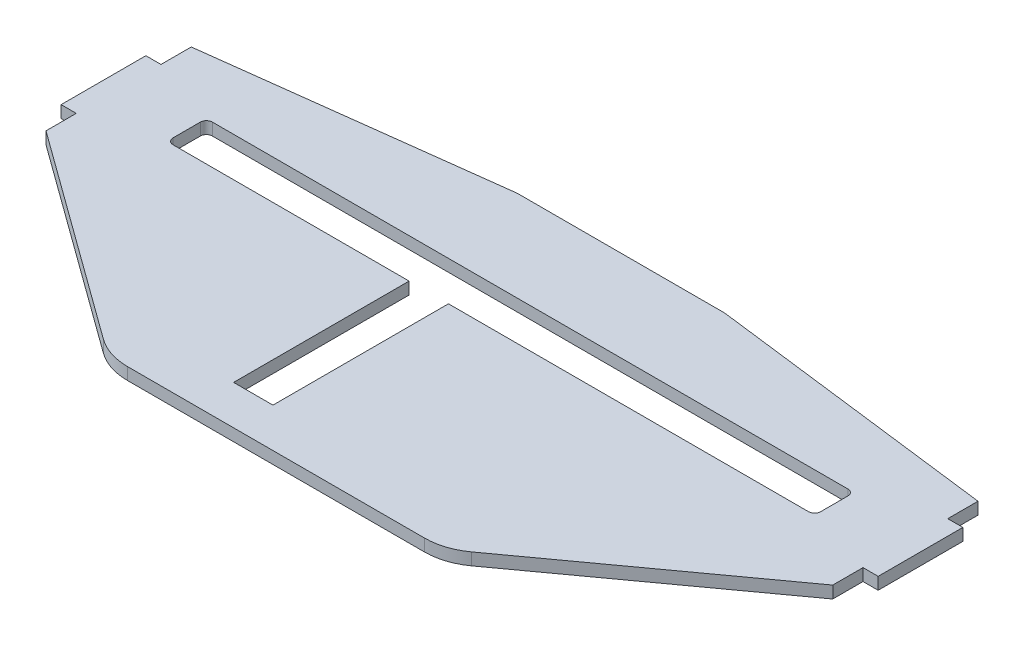
ISO-10303-21;
HEADER;
FILE_DESCRIPTION(('STEP AP214'),'2;1');
FILE_NAME('part.step','',(''),(''),'','','');
FILE_SCHEMA(('AUTOMOTIVE_DESIGN { 1 0 10303 214 1 1 1 1 }'));
ENDSEC;
DATA;
#1=APPLICATION_CONTEXT('core data for automotive mechanical design processes');
#2=APPLICATION_PROTOCOL_DEFINITION('international standard','automotive_design',2000,#1);
#3=PRODUCT_CONTEXT('',#1,'mechanical');
#4=PRODUCT('Part','Part','',(#3));
#5=PRODUCT_RELATED_PRODUCT_CATEGORY('part','',(#4));
#6=PRODUCT_DEFINITION_FORMATION('','',#4);
#7=PRODUCT_DEFINITION_CONTEXT('part definition',#1,'design');
#8=PRODUCT_DEFINITION('design','',#6,#7);
#9=PRODUCT_DEFINITION_SHAPE('','',#8);
#10=(LENGTH_UNIT() NAMED_UNIT(*) SI_UNIT(.MILLI.,.METRE.));
#11=(NAMED_UNIT(*) PLANE_ANGLE_UNIT() SI_UNIT($,.RADIAN.));
#12=(NAMED_UNIT(*) SI_UNIT($,.STERADIAN.) SOLID_ANGLE_UNIT());
#13=UNCERTAINTY_MEASURE_WITH_UNIT(LENGTH_MEASURE(1.E-05),#10,'distance_accuracy_value','');
#14=(GEOMETRIC_REPRESENTATION_CONTEXT(3) GLOBAL_UNCERTAINTY_ASSIGNED_CONTEXT((#13)) GLOBAL_UNIT_ASSIGNED_CONTEXT((#10,
#11,#12)) REPRESENTATION_CONTEXT('',''));
#15=CARTESIAN_POINT('',(0.,0.,0.));
#16=DIRECTION('',(0.,0.,1.));
#17=DIRECTION('',(1.,0.,0.));
#18=AXIS2_PLACEMENT_3D('',#15,#16,#17);
#19=CARTESIAN_POINT('',(-65.,2.,-22.690493718196));
#20=DIRECTION('',(1.,0.,0.));
#21=DIRECTION('',(0.,0.,-1.));
#22=AXIS2_PLACEMENT_3D('',#19,#20,#21);
#23=PLANE('',#22);
#24=DIRECTION('',(0.,0.,1.));
#25=VECTOR('',#24,1.);
#26=CARTESIAN_POINT('',(-65.,0.,-22.690493718196));
#27=LINE('',#26,#25);
#28=CARTESIAN_POINT('',(-65.,0.,-27.690493718196));
#29=VERTEX_POINT('',#28);
#30=CARTESIAN_POINT('',(-65.,0.,-22.690493718196));
#31=VERTEX_POINT('',#30);
#32=EDGE_CURVE('E420',#29,#31,#27,.T.);
#33=ORIENTED_EDGE('',*,*,#32,.T.);
#34=DIRECTION('',(0.,-1.,0.));
#35=VECTOR('',#34,1.);
#36=CARTESIAN_POINT('',(-65.,2.,-22.690493718196));
#37=LINE('',#36,#35);
#38=CARTESIAN_POINT('',(-65.,2.,-22.690493718196));
#39=VERTEX_POINT('',#38);
#40=EDGE_CURVE('E11',#39,#31,#37,.T.);
#41=ORIENTED_EDGE('',*,*,#40,.F.);
#42=DIRECTION('',(0.,0.,1.));
#43=VECTOR('',#42,1.);
#44=CARTESIAN_POINT('',(-65.,2.,-22.690493718196));
#45=LINE('',#44,#43);
#46=CARTESIAN_POINT('',(-65.,2.,-27.690493718196));
#47=VERTEX_POINT('',#46);
#48=EDGE_CURVE('E421',#47,#39,#45,.T.);
#49=ORIENTED_EDGE('',*,*,#48,.F.);
#50=DIRECTION('',(0.,-1.,0.));
#51=VECTOR('',#50,1.);
#52=CARTESIAN_POINT('',(-65.,2.,-27.690493718196));
#53=LINE('',#52,#51);
#54=EDGE_CURVE('E445',#47,#29,#53,.T.);
#55=ORIENTED_EDGE('',*,*,#54,.T.);
#56=EDGE_LOOP('',(#33,#41,#49,#55));
#57=FACE_BOUND('',#56,.T.);
#58=ADVANCED_FACE('F36',(#57),#23,.F.);
#59=CARTESIAN_POINT('',(-67.5,2.,-22.690493718196));
#60=DIRECTION('',(0.,0.,1.));
#61=DIRECTION('',(1.,0.,0.));
#62=AXIS2_PLACEMENT_3D('',#59,#60,#61);
#63=PLANE('',#62);
#64=DIRECTION('',(-1.,0.,0.));
#65=VECTOR('',#64,1.);
#66=CARTESIAN_POINT('',(-67.5,0.,-22.690493718196));
#67=LINE('',#66,#65);
#68=CARTESIAN_POINT('',(-67.5,0.,-22.690493718196));
#69=VERTEX_POINT('',#68);
#70=EDGE_CURVE('E448',#31,#69,#67,.T.);
#71=ORIENTED_EDGE('',*,*,#70,.T.);
#72=DIRECTION('',(0.,-1.,0.));
#73=VECTOR('',#72,1.);
#74=CARTESIAN_POINT('',(-67.5,2.,-22.690493718196));
#75=LINE('',#74,#73);
#76=CARTESIAN_POINT('',(-67.5,2.,-22.690493718196));
#77=VERTEX_POINT('',#76);
#78=EDGE_CURVE('E43',#77,#69,#75,.T.);
#79=ORIENTED_EDGE('',*,*,#78,.F.);
#80=DIRECTION('',(-1.,0.,0.));
#81=VECTOR('',#80,1.);
#82=CARTESIAN_POINT('',(-67.5,2.,-22.690493718196));
#83=LINE('',#82,#81);
#84=EDGE_CURVE('E424',#39,#77,#83,.T.);
#85=ORIENTED_EDGE('',*,*,#84,.F.);
#86=ORIENTED_EDGE('',*,*,#40,.T.);
#87=EDGE_LOOP('',(#71,#79,#85,#86));
#88=FACE_BOUND('',#87,.T.);
#89=ADVANCED_FACE('F515',(#88),#63,.F.);
#90=CARTESIAN_POINT('',(-67.5,2.,-8.69049371819603));
#91=DIRECTION('',(1.,0.,0.));
#92=DIRECTION('',(0.,0.,-1.));
#93=AXIS2_PLACEMENT_3D('',#90,#91,#92);
#94=PLANE('',#93);
#95=DIRECTION('',(0.,0.,1.));
#96=VECTOR('',#95,1.);
#97=CARTESIAN_POINT('',(-67.5,0.,-8.69049371819603));
#98=LINE('',#97,#96);
#99=CARTESIAN_POINT('',(-67.5,0.,-8.69049371819603));
#100=VERTEX_POINT('',#99);
#101=EDGE_CURVE('E450',#69,#100,#98,.T.);
#102=ORIENTED_EDGE('',*,*,#101,.T.);
#103=DIRECTION('',(0.,-1.,0.));
#104=VECTOR('',#103,1.);
#105=CARTESIAN_POINT('',(-67.5,2.,-8.69049371819603));
#106=LINE('',#105,#104);
#107=CARTESIAN_POINT('',(-67.5,2.,-8.69049371819603));
#108=VERTEX_POINT('',#107);
#109=EDGE_CURVE('E487',#108,#100,#106,.T.);
#110=ORIENTED_EDGE('',*,*,#109,.F.);
#111=DIRECTION('',(0.,0.,1.));
#112=VECTOR('',#111,1.);
#113=CARTESIAN_POINT('',(-67.5,2.,-8.69049371819603));
#114=LINE('',#113,#112);
#115=EDGE_CURVE('E427',#77,#108,#114,.T.);
#116=ORIENTED_EDGE('',*,*,#115,.F.);
#117=ORIENTED_EDGE('',*,*,#78,.T.);
#118=EDGE_LOOP('',(#102,#110,#116,#117));
#119=FACE_BOUND('',#118,.T.);
#120=ADVANCED_FACE('F494',(#119),#94,.F.);
#121=CARTESIAN_POINT('',(-65.,2.,-8.69049371819603));
#122=DIRECTION('',(0.,0.,-1.));
#123=DIRECTION('',(-1.,0.,0.));
#124=AXIS2_PLACEMENT_3D('',#121,#122,#123);
#125=PLANE('',#124);
#126=DIRECTION('',(1.,0.,0.));
#127=VECTOR('',#126,1.);
#128=CARTESIAN_POINT('',(-65.,0.,-8.69049371819603));
#129=LINE('',#128,#127);
#130=CARTESIAN_POINT('',(-65.,0.,-8.69049371819603));
#131=VERTEX_POINT('',#130);
#132=EDGE_CURVE('E452',#100,#131,#129,.T.);
#133=ORIENTED_EDGE('',*,*,#132,.T.);
#134=DIRECTION('',(0.,-1.,0.));
#135=VECTOR('',#134,1.);
#136=CARTESIAN_POINT('',(-65.,2.,-8.69049371819603));
#137=LINE('',#136,#135);
#138=CARTESIAN_POINT('',(-65.,2.,-8.69049371819603));
#139=VERTEX_POINT('',#138);
#140=EDGE_CURVE('E484',#139,#131,#137,.T.);
#141=ORIENTED_EDGE('',*,*,#140,.F.);
#142=DIRECTION('',(1.,0.,0.));
#143=VECTOR('',#142,1.);
#144=CARTESIAN_POINT('',(-65.,2.,-8.69049371819603));
#145=LINE('',#144,#143);
#146=EDGE_CURVE('E429',#108,#139,#145,.T.);
#147=ORIENTED_EDGE('',*,*,#146,.F.);
#148=ORIENTED_EDGE('',*,*,#109,.T.);
#149=EDGE_LOOP('',(#133,#141,#147,#148));
#150=FACE_BOUND('',#149,.T.);
#151=ADVANCED_FACE('F503',(#150),#125,.F.);
#152=CARTESIAN_POINT('',(-65.,2.,-3.69049371819603));
#153=DIRECTION('',(1.,0.,0.));
#154=DIRECTION('',(0.,0.,-1.));
#155=AXIS2_PLACEMENT_3D('',#152,#153,#154);
#156=PLANE('',#155);
#157=DIRECTION('',(0.,0.,1.));
#158=VECTOR('',#157,1.);
#159=CARTESIAN_POINT('',(-65.,0.,-3.69049371819603));
#160=LINE('',#159,#158);
#161=CARTESIAN_POINT('',(-65.,0.,-3.69049371819603));
#162=VERTEX_POINT('',#161);
#163=EDGE_CURVE('E454',#131,#162,#160,.T.);
#164=ORIENTED_EDGE('',*,*,#163,.T.);
#165=DIRECTION('',(0.,-1.,0.));
#166=VECTOR('',#165,1.);
#167=CARTESIAN_POINT('',(-65.,2.,-3.69049371819603));
#168=LINE('',#167,#166);
#169=CARTESIAN_POINT('',(-65.,2.,-3.69049371819603));
#170=VERTEX_POINT('',#169);
#171=EDGE_CURVE('E481',#170,#162,#168,.T.);
#172=ORIENTED_EDGE('',*,*,#171,.F.);
#173=DIRECTION('',(0.,0.,1.));
#174=VECTOR('',#173,1.);
#175=CARTESIAN_POINT('',(-65.,2.,-3.69049371819603));
#176=LINE('',#175,#174);
#177=EDGE_CURVE('E431',#139,#170,#176,.T.);
#178=ORIENTED_EDGE('',*,*,#177,.F.);
#179=ORIENTED_EDGE('',*,*,#140,.T.);
#180=EDGE_LOOP('',(#164,#172,#178,#179));
#181=FACE_BOUND('',#180,.T.);
#182=ADVANCED_FACE('F507',(#181),#156,.F.);
#183=CARTESIAN_POINT('',(-30.4139007462659,2.,21.4034902651962));
#184=DIRECTION('',(0.587259936285379,0.,-0.809398398339219));
#185=DIRECTION('',(-0.809398398339219,0.,-0.587259936285379));
#186=AXIS2_PLACEMENT_3D('',#183,#184,#185);
#187=PLANE('',#186);
#188=DIRECTION('',(0.809398398339219,0.,0.587259936285379));
#189=VECTOR('',#188,1.);
#190=CARTESIAN_POINT('',(-30.4139007462659,0.,21.4034902651962));
#191=LINE('',#190,#189);
#192=CARTESIAN_POINT('',(-30.4139007462659,0.,21.4034902651962));
#193=VERTEX_POINT('',#192);
#194=EDGE_CURVE('E456',#162,#193,#191,.T.);
#195=ORIENTED_EDGE('',*,*,#194,.T.);
#196=DIRECTION('',(0.,-1.,0.));
#197=VECTOR('',#196,1.);
#198=CARTESIAN_POINT('',(-30.4139007462659,2.,21.4034902651962));
#199=LINE('',#198,#197);
#200=CARTESIAN_POINT('',(-30.4139007462659,2.,21.4034902651962));
#201=VERTEX_POINT('',#200);
#202=EDGE_CURVE('E478',#201,#193,#199,.T.);
#203=ORIENTED_EDGE('',*,*,#202,.F.);
#204=DIRECTION('',(0.809398398339219,0.,0.587259936285379));
#205=VECTOR('',#204,1.);
#206=CARTESIAN_POINT('',(-30.4139007462659,2.,21.4034902651962));
#207=LINE('',#206,#205);
#208=EDGE_CURVE('E433',#170,#201,#207,.T.);
#209=ORIENTED_EDGE('',*,*,#208,.F.);
#210=ORIENTED_EDGE('',*,*,#171,.T.);
#211=EDGE_LOOP('',(#195,#203,#209,#210));
#212=FACE_BOUND('',#211,.T.);
#213=ADVANCED_FACE('F578',(#212),#187,.F.);
#214=CARTESIAN_POINT('',(-24.5413013834122,2.,13.309506281804));
#215=DIRECTION('',(0.,-1.,0.));
#216=DIRECTION('',(0.,0.,-1.));
#217=AXIS2_PLACEMENT_3D('',#214,#215,#216);
#218=CYLINDRICAL_SURFACE('',#217,10.);
#219=CARTESIAN_POINT('',(-24.5413013834122,0.,13.309506281804));
#220=DIRECTION('',(0.,1.,0.));
#221=DIRECTION('',(0.,0.,-1.));
#222=AXIS2_PLACEMENT_3D('',#219,#220,#221);
#223=CIRCLE('',#222,10.);
#224=CARTESIAN_POINT('',(-24.5413013834122,0.,23.309506281804));
#225=VERTEX_POINT('',#224);
#226=EDGE_CURVE('E458',#193,#225,#223,.T.);
#227=ORIENTED_EDGE('',*,*,#226,.T.);
#228=DIRECTION('',(0.,-1.,0.));
#229=VECTOR('',#228,1.);
#230=CARTESIAN_POINT('',(-24.5413013834122,2.,23.309506281804));
#231=LINE('',#230,#229);
#232=CARTESIAN_POINT('',(-24.5413013834122,2.,23.309506281804));
#233=VERTEX_POINT('',#232);
#234=EDGE_CURVE('E475',#233,#225,#231,.T.);
#235=ORIENTED_EDGE('',*,*,#234,.F.);
#236=CARTESIAN_POINT('',(-24.5413013834122,2.,13.309506281804));
#237=DIRECTION('',(0.,1.,0.));
#238=DIRECTION('',(0.,0.,-1.));
#239=AXIS2_PLACEMENT_3D('',#236,#237,#238);
#240=CIRCLE('',#239,10.);
#241=EDGE_CURVE('E435',#201,#233,#240,.T.);
#242=ORIENTED_EDGE('',*,*,#241,.F.);
#243=ORIENTED_EDGE('',*,*,#202,.T.);
#244=EDGE_LOOP('',(#227,#235,#242,#243));
#245=FACE_BOUND('',#244,.T.);
#246=ADVANCED_FACE('F576',(#245),#218,.T.);
#247=CARTESIAN_POINT('',(0.,2.,23.309506281804));
#248=DIRECTION('',(0.,0.,-1.));
#249=DIRECTION('',(-1.,0.,0.));
#250=AXIS2_PLACEMENT_3D('',#247,#248,#249);
#251=PLANE('',#250);
#252=DIRECTION('',(1.,0.,0.));
#253=VECTOR('',#252,1.);
#254=CARTESIAN_POINT('',(0.,0.,23.309506281804));
#255=LINE('',#254,#253);
#256=CARTESIAN_POINT('',(24.5413013834122,0.,23.309506281804));
#257=VERTEX_POINT('',#256);
#258=EDGE_CURVE('E460',#225,#257,#255,.T.);
#259=ORIENTED_EDGE('',*,*,#258,.T.);
#260=DIRECTION('',(0.,-1.,0.));
#261=VECTOR('',#260,1.);
#262=CARTESIAN_POINT('',(24.5413013834122,2.,23.309506281804));
#263=LINE('',#262,#261);
#264=CARTESIAN_POINT('',(24.5413013834122,2.,23.309506281804));
#265=VERTEX_POINT('',#264);
#266=EDGE_CURVE('E410',#265,#257,#263,.T.);
#267=ORIENTED_EDGE('',*,*,#266,.F.);
#268=DIRECTION('',(1.,0.,0.));
#269=VECTOR('',#268,1.);
#270=CARTESIAN_POINT('',(0.,2.,23.309506281804));
#271=LINE('',#270,#269);
#272=EDGE_CURVE('E437',#233,#265,#271,.T.);
#273=ORIENTED_EDGE('',*,*,#272,.F.);
#274=ORIENTED_EDGE('',*,*,#234,.T.);
#275=EDGE_LOOP('',(#259,#267,#273,#274));
#276=FACE_BOUND('',#275,.T.);
#277=ADVANCED_FACE('F572',(#276),#251,.F.);
#278=CARTESIAN_POINT('',(-16.5303257419357,2.,-33.690493718196));
#279=DIRECTION('',(0.,0.,1.));
#280=DIRECTION('',(1.,0.,0.));
#281=AXIS2_PLACEMENT_3D('',#278,#279,#280);
#282=PLANE('',#281);
#283=DIRECTION('',(-1.,0.,0.));
#284=VECTOR('',#283,1.);
#285=CARTESIAN_POINT('',(-16.5303257419357,0.,-33.690493718196));
#286=LINE('',#285,#284);
#287=CARTESIAN_POINT('',(16.5303257419357,0.,-33.690493718196));
#288=VERTEX_POINT('',#287);
#289=CARTESIAN_POINT('',(-16.5303257419357,0.,-33.690493718196));
#290=VERTEX_POINT('',#289);
#291=EDGE_CURVE('E462',#288,#290,#286,.T.);
#292=ORIENTED_EDGE('',*,*,#291,.T.);
#293=DIRECTION('',(0.,-1.,0.));
#294=VECTOR('',#293,1.);
#295=CARTESIAN_POINT('',(-16.5303257419357,2.,-33.690493718196));
#296=LINE('',#295,#294);
#297=CARTESIAN_POINT('',(-16.5303257419357,2.,-33.690493718196));
#298=VERTEX_POINT('',#297);
#299=EDGE_CURVE('E472',#298,#290,#296,.T.);
#300=ORIENTED_EDGE('',*,*,#299,.F.);
#301=DIRECTION('',(-1.,0.,0.));
#302=VECTOR('',#301,1.);
#303=CARTESIAN_POINT('',(-16.5303257419357,2.,-33.690493718196));
#304=LINE('',#303,#302);
#305=CARTESIAN_POINT('',(16.5303257419357,2.,-33.690493718196));
#306=VERTEX_POINT('',#305);
#307=EDGE_CURVE('E439',#306,#298,#304,.T.);
#308=ORIENTED_EDGE('',*,*,#307,.F.);
#309=DIRECTION('',(0.,-1.,0.));
#310=VECTOR('',#309,1.);
#311=CARTESIAN_POINT('',(16.5303257419357,2.,-33.690493718196));
#312=LINE('',#311,#310);
#313=EDGE_CURVE('E413',#306,#288,#312,.T.);
#314=ORIENTED_EDGE('',*,*,#313,.T.);
#315=EDGE_LOOP('',(#292,#300,#308,#314));
#316=FACE_BOUND('',#315,.T.);
#317=ADVANCED_FACE('F529',(#316),#282,.F.);
#318=CARTESIAN_POINT('',(-16.5303257419357,2.,-23.690493718196));
#319=DIRECTION('',(0.,-1.,0.));
#320=DIRECTION('',(0.,0.,-1.));
#321=AXIS2_PLACEMENT_3D('',#318,#319,#320);
#322=CYLINDRICAL_SURFACE('',#321,10.);
#323=CARTESIAN_POINT('',(-16.5303257419357,0.,-23.690493718196));
#324=DIRECTION('',(0.,1.,0.));
#325=DIRECTION('',(0.,0.,1.));
#326=AXIS2_PLACEMENT_3D('',#323,#324,#325);
#327=CIRCLE('',#326,10.);
#328=CARTESIAN_POINT('',(-17.7746267588119,0.,-33.6127774764546));
#329=VERTEX_POINT('',#328);
#330=EDGE_CURVE('E464',#290,#329,#327,.T.);
#331=ORIENTED_EDGE('',*,*,#330,.T.);
#332=DIRECTION('',(0.,-1.,0.));
#333=VECTOR('',#332,1.);
#334=CARTESIAN_POINT('',(-17.7746267588119,2.,-33.6127774764546));
#335=LINE('',#334,#333);
#336=CARTESIAN_POINT('',(-17.7746267588119,2.,-33.6127774764546));
#337=VERTEX_POINT('',#336);
#338=EDGE_CURVE('E469',#337,#329,#335,.T.);
#339=ORIENTED_EDGE('',*,*,#338,.F.);
#340=CARTESIAN_POINT('',(-16.5303257419357,2.,-23.690493718196));
#341=DIRECTION('',(0.,1.,0.));
#342=DIRECTION('',(0.,0.,1.));
#343=AXIS2_PLACEMENT_3D('',#340,#341,#342);
#344=CIRCLE('',#343,10.);
#345=EDGE_CURVE('E441',#298,#337,#344,.T.);
#346=ORIENTED_EDGE('',*,*,#345,.F.);
#347=ORIENTED_EDGE('',*,*,#299,.T.);
#348=EDGE_LOOP('',(#331,#339,#346,#347));
#349=FACE_BOUND('',#348,.T.);
#350=ADVANCED_FACE('F526',(#349),#322,.T.);
#351=CARTESIAN_POINT('',(-65.,2.,-27.690493718196));
#352=DIRECTION('',(0.124430101687617,0.,0.992228375825853));
#353=DIRECTION('',(0.992228375825853,0.,-0.124430101687617));
#354=AXIS2_PLACEMENT_3D('',#351,#352,#353);
#355=PLANE('',#354);
#356=DIRECTION('',(-0.992228375825853,0.,0.124430101687617));
#357=VECTOR('',#356,1.);
#358=CARTESIAN_POINT('',(-65.,0.,-27.690493718196));
#359=LINE('',#358,#357);
#360=EDGE_CURVE('E425',#329,#29,#359,.T.);
#361=ORIENTED_EDGE('',*,*,#360,.T.);
#362=ORIENTED_EDGE('',*,*,#54,.F.);
#363=DIRECTION('',(-0.992228375825853,0.,0.124430101687617));
#364=VECTOR('',#363,1.);
#365=CARTESIAN_POINT('',(-65.,2.,-27.690493718196));
#366=LINE('',#365,#364);
#367=EDGE_CURVE('E443',#337,#47,#366,.T.);
#368=ORIENTED_EDGE('',*,*,#367,.F.);
#369=ORIENTED_EDGE('',*,*,#338,.T.);
#370=EDGE_LOOP('',(#361,#362,#368,#369));
#371=FACE_BOUND('',#370,.T.);
#372=ADVANCED_FACE('F521',(#371),#355,.F.);
#373=CARTESIAN_POINT('',(-16.5303257419357,2.,-23.690493718196));
#374=DIRECTION('',(0.,1.,0.));
#375=DIRECTION('',(0.,0.,1.));
#376=AXIS2_PLACEMENT_3D('',#373,#374,#375);
#377=PLANE('',#376);
#378=CARTESIAN_POINT('',(52.5,2.,-13.190493718196));
#379=DIRECTION('',(0.,1.,0.));
#380=DIRECTION('',(0.,0.,-1.));
#381=AXIS2_PLACEMENT_3D('',#378,#379,#380);
#382=CIRCLE('',#381,0.999999999999997);
#383=CARTESIAN_POINT('',(52.5,2.,-12.190493718196));
#384=VERTEX_POINT('',#383);
#385=CARTESIAN_POINT('',(53.5,2.,-13.190493718196));
#386=VERTEX_POINT('',#385);
#387=EDGE_CURVE('E50',#384,#386,#382,.T.);
#388=ORIENTED_EDGE('',*,*,#387,.F.);
#389=DIRECTION('',(1.,0.,0.));
#390=VECTOR('',#389,1.);
#391=CARTESIAN_POINT('',(-6.99999999999999,2.,-12.190493718196));
#392=LINE('',#391,#390);
#393=CARTESIAN_POINT('',(-6.99999999999999,2.,-12.190493718196));
#394=VERTEX_POINT('',#393);
#395=EDGE_CURVE('E263',#394,#384,#392,.T.);
#396=ORIENTED_EDGE('',*,*,#395,.F.);
#397=DIRECTION('',(0.,0.,-1.));
#398=VECTOR('',#397,1.);
#399=CARTESIAN_POINT('',(-6.99999999999999,2.,16.809506281804));
#400=LINE('',#399,#398);
#401=CARTESIAN_POINT('',(-6.99999999999999,2.,16.809506281804));
#402=VERTEX_POINT('',#401);
#403=EDGE_CURVE('E266',#402,#394,#400,.T.);
#404=ORIENTED_EDGE('',*,*,#403,.F.);
#405=DIRECTION('',(1.,0.,0.));
#406=VECTOR('',#405,1.);
#407=CARTESIAN_POINT('',(-13.5,2.,16.809506281804));
#408=LINE('',#407,#406);
#409=CARTESIAN_POINT('',(-13.5,2.,16.809506281804));
#410=VERTEX_POINT('',#409);
#411=EDGE_CURVE('E318',#410,#402,#408,.T.);
#412=ORIENTED_EDGE('',*,*,#411,.F.);
#413=DIRECTION('',(0.,0.,1.));
#414=VECTOR('',#413,1.);
#415=CARTESIAN_POINT('',(-13.5,2.,16.809506281804));
#416=LINE('',#415,#414);
#417=CARTESIAN_POINT('',(-13.5,2.,-12.190493718196));
#418=VERTEX_POINT('',#417);
#419=EDGE_CURVE('E315',#418,#410,#416,.T.);
#420=ORIENTED_EDGE('',*,*,#419,.F.);
#421=DIRECTION('',(1.,0.,0.));
#422=VECTOR('',#421,1.);
#423=CARTESIAN_POINT('',(-52.5,2.,-12.190493718196));
#424=LINE('',#423,#422);
#425=CARTESIAN_POINT('',(-52.5,2.,-12.190493718196));
#426=VERTEX_POINT('',#425);
#427=EDGE_CURVE('E312',#426,#418,#424,.T.);
#428=ORIENTED_EDGE('',*,*,#427,.F.);
#429=CARTESIAN_POINT('',(-52.5,2.,-13.190493718196));
#430=DIRECTION('',(0.,1.,0.));
#431=DIRECTION('',(0.,0.,1.));
#432=AXIS2_PLACEMENT_3D('',#429,#430,#431);
#433=CIRCLE('',#432,1.);
#434=CARTESIAN_POINT('',(-53.5,2.,-13.190493718196));
#435=VERTEX_POINT('',#434);
#436=EDGE_CURVE('E309',#435,#426,#433,.T.);
#437=ORIENTED_EDGE('',*,*,#436,.F.);
#438=DIRECTION('',(0.,0.,1.));
#439=VECTOR('',#438,1.);
#440=CARTESIAN_POINT('',(-53.5,2.,-17.690493718196));
#441=LINE('',#440,#439);
#442=CARTESIAN_POINT('',(-53.5,2.,-17.690493718196));
#443=VERTEX_POINT('',#442);
#444=EDGE_CURVE('E306',#443,#435,#441,.T.);
#445=ORIENTED_EDGE('',*,*,#444,.F.);
#446=CARTESIAN_POINT('',(-52.5,2.,-17.690493718196));
#447=DIRECTION('',(0.,1.,0.));
#448=DIRECTION('',(0.,0.,-1.));
#449=AXIS2_PLACEMENT_3D('',#446,#447,#448);
#450=CIRCLE('',#449,1.);
#451=CARTESIAN_POINT('',(-52.5,2.,-18.690493718196));
#452=VERTEX_POINT('',#451);
#453=EDGE_CURVE('E303',#452,#443,#450,.T.);
#454=ORIENTED_EDGE('',*,*,#453,.F.);
#455=DIRECTION('',(-1.,0.,0.));
#456=VECTOR('',#455,1.);
#457=CARTESIAN_POINT('',(-52.5,2.,-18.690493718196));
#458=LINE('',#457,#456);
#459=CARTESIAN_POINT('',(52.5,2.,-18.690493718196));
#460=VERTEX_POINT('',#459);
#461=EDGE_CURVE('E300',#460,#452,#458,.T.);
#462=ORIENTED_EDGE('',*,*,#461,.F.);
#463=CARTESIAN_POINT('',(52.5,2.,-17.690493718196));
#464=DIRECTION('',(0.,1.,0.));
#465=DIRECTION('',(0.,0.,1.));
#466=AXIS2_PLACEMENT_3D('',#463,#464,#465);
#467=CIRCLE('',#466,0.999999999999999);
#468=CARTESIAN_POINT('',(53.5,2.,-17.690493718196));
#469=VERTEX_POINT('',#468);
#470=EDGE_CURVE('E297',#469,#460,#467,.T.);
#471=ORIENTED_EDGE('',*,*,#470,.F.);
#472=DIRECTION('',(0.,0.,-1.));
#473=VECTOR('',#472,1.);
#474=CARTESIAN_POINT('',(53.5,2.,-17.690493718196));
#475=LINE('',#474,#473);
#476=EDGE_CURVE('E295',#386,#469,#475,.T.);
#477=ORIENTED_EDGE('',*,*,#476,.F.);
#478=EDGE_LOOP('',(#388,#396,#404,#412,#420,#428,#437,#445,#454,#462,#471,#477));
#479=FACE_BOUND('',#478,.T.);
#480=ORIENTED_EDGE('',*,*,#48,.T.);
#481=ORIENTED_EDGE('',*,*,#84,.T.);
#482=ORIENTED_EDGE('',*,*,#115,.T.);
#483=ORIENTED_EDGE('',*,*,#146,.T.);
#484=ORIENTED_EDGE('',*,*,#177,.T.);
#485=ORIENTED_EDGE('',*,*,#208,.T.);
#486=ORIENTED_EDGE('',*,*,#241,.T.);
#487=ORIENTED_EDGE('',*,*,#272,.T.);
#488=CARTESIAN_POINT('',(24.5413013834122,2.,13.309506281804));
#489=DIRECTION('',(0.,-1.,0.));
#490=DIRECTION('',(0.,0.,-1.));
#491=AXIS2_PLACEMENT_3D('',#488,#489,#490);
#492=CIRCLE('',#491,10.);
#493=CARTESIAN_POINT('',(30.4139007462659,2.,21.4034902651962));
#494=VERTEX_POINT('',#493);
#495=EDGE_CURVE('E355',#494,#265,#492,.T.);
#496=ORIENTED_EDGE('',*,*,#495,.F.);
#497=DIRECTION('',(-0.809398398339219,0.,0.587259936285379));
#498=VECTOR('',#497,1.);
#499=CARTESIAN_POINT('',(30.4139007462659,2.,21.4034902651962));
#500=LINE('',#499,#498);
#501=CARTESIAN_POINT('',(65.,2.,-3.69049371819604));
#502=VERTEX_POINT('',#501);
#503=EDGE_CURVE('E358',#502,#494,#500,.T.);
#504=ORIENTED_EDGE('',*,*,#503,.F.);
#505=DIRECTION('',(0.,0.,1.));
#506=VECTOR('',#505,1.);
#507=CARTESIAN_POINT('',(65.,2.,-3.69049371819604));
#508=LINE('',#507,#506);
#509=CARTESIAN_POINT('',(65.,2.,-8.69049371819604));
#510=VERTEX_POINT('',#509);
#511=EDGE_CURVE('E361',#510,#502,#508,.T.);
#512=ORIENTED_EDGE('',*,*,#511,.F.);
#513=DIRECTION('',(-1.,0.,0.));
#514=VECTOR('',#513,1.);
#515=CARTESIAN_POINT('',(65.,2.,-8.69049371819604));
#516=LINE('',#515,#514);
#517=CARTESIAN_POINT('',(67.5,2.,-8.69049371819604));
#518=VERTEX_POINT('',#517);
#519=EDGE_CURVE('E364',#518,#510,#516,.T.);
#520=ORIENTED_EDGE('',*,*,#519,.F.);
#521=DIRECTION('',(0.,0.,1.));
#522=VECTOR('',#521,1.);
#523=CARTESIAN_POINT('',(67.5,2.,-8.69049371819604));
#524=LINE('',#523,#522);
#525=CARTESIAN_POINT('',(67.5,2.,-22.690493718196));
#526=VERTEX_POINT('',#525);
#527=EDGE_CURVE('E367',#526,#518,#524,.T.);
#528=ORIENTED_EDGE('',*,*,#527,.F.);
#529=DIRECTION('',(1.,0.,0.));
#530=VECTOR('',#529,1.);
#531=CARTESIAN_POINT('',(67.5,2.,-22.690493718196));
#532=LINE('',#531,#530);
#533=CARTESIAN_POINT('',(65.,2.,-22.690493718196));
#534=VERTEX_POINT('',#533);
#535=EDGE_CURVE('E370',#534,#526,#532,.T.);
#536=ORIENTED_EDGE('',*,*,#535,.F.);
#537=DIRECTION('',(0.,0.,1.));
#538=VECTOR('',#537,1.);
#539=CARTESIAN_POINT('',(65.,2.,-22.690493718196));
#540=LINE('',#539,#538);
#541=CARTESIAN_POINT('',(65.,2.,-27.690493718196));
#542=VERTEX_POINT('',#541);
#543=EDGE_CURVE('E345',#542,#534,#540,.T.);
#544=ORIENTED_EDGE('',*,*,#543,.F.);
#545=DIRECTION('',(0.992228375825853,0.,0.124430101687617));
#546=VECTOR('',#545,1.);
#547=CARTESIAN_POINT('',(65.,2.,-27.690493718196));
#548=LINE('',#547,#546);
#549=CARTESIAN_POINT('',(17.7746267588119,2.,-33.6127774764546));
#550=VERTEX_POINT('',#549);
#551=EDGE_CURVE('E348',#550,#542,#548,.T.);
#552=ORIENTED_EDGE('',*,*,#551,.F.);
#553=CARTESIAN_POINT('',(16.5303257419357,2.,-23.690493718196));
#554=DIRECTION('',(0.,-1.,0.));
#555=DIRECTION('',(0.,0.,1.));
#556=AXIS2_PLACEMENT_3D('',#553,#554,#555);
#557=CIRCLE('',#556,10.);
#558=EDGE_CURVE('E352',#306,#550,#557,.T.);
#559=ORIENTED_EDGE('',*,*,#558,.F.);
#560=ORIENTED_EDGE('',*,*,#307,.T.);
#561=ORIENTED_EDGE('',*,*,#345,.T.);
#562=ORIENTED_EDGE('',*,*,#367,.T.);
#563=EDGE_LOOP('',(#480,#481,#482,#483,#484,#485,#486,#487,#496,#504,#512,#520,#528,#536,#544,
#552,#559,#560,#561,#562));
#564=FACE_BOUND('',#563,.T.);
#565=ADVANCED_FACE('F511',(#479,#564),#377,.T.);
#566=CARTESIAN_POINT('',(-16.5303257419357,0.,-23.690493718196));
#567=DIRECTION('',(0.,1.,0.));
#568=DIRECTION('',(0.,0.,1.));
#569=AXIS2_PLACEMENT_3D('',#566,#567,#568);
#570=PLANE('',#569);
#571=DIRECTION('',(1.,0.,0.));
#572=VECTOR('',#571,1.);
#573=CARTESIAN_POINT('',(-6.99999999999999,0.,-12.190493718196));
#574=LINE('',#573,#572);
#575=CARTESIAN_POINT('',(-6.99999999999999,0.,-12.190493718196));
#576=VERTEX_POINT('',#575);
#577=CARTESIAN_POINT('',(52.5,0.,-12.190493718196));
#578=VERTEX_POINT('',#577);
#579=EDGE_CURVE('E252',#576,#578,#574,.T.);
#580=ORIENTED_EDGE('',*,*,#579,.T.);
#581=CARTESIAN_POINT('',(52.5,0.,-13.190493718196));
#582=DIRECTION('',(0.,1.,0.));
#583=DIRECTION('',(0.,0.,-1.));
#584=AXIS2_PLACEMENT_3D('',#581,#582,#583);
#585=CIRCLE('',#584,0.999999999999997);
#586=CARTESIAN_POINT('',(53.5,0.,-13.190493718196));
#587=VERTEX_POINT('',#586);
#588=EDGE_CURVE('E246',#578,#587,#585,.T.);
#589=ORIENTED_EDGE('',*,*,#588,.T.);
#590=DIRECTION('',(0.,0.,-1.));
#591=VECTOR('',#590,1.);
#592=CARTESIAN_POINT('',(53.5,0.,-17.690493718196));
#593=LINE('',#592,#591);
#594=CARTESIAN_POINT('',(53.5,0.,-17.690493718196));
#595=VERTEX_POINT('',#594);
#596=EDGE_CURVE('E255',#587,#595,#593,.T.);
#597=ORIENTED_EDGE('',*,*,#596,.T.);
#598=CARTESIAN_POINT('',(52.5,0.,-17.690493718196));
#599=DIRECTION('',(0.,1.,0.));
#600=DIRECTION('',(0.,0.,1.));
#601=AXIS2_PLACEMENT_3D('',#598,#599,#600);
#602=CIRCLE('',#601,0.999999999999999);
#603=CARTESIAN_POINT('',(52.5,0.,-18.690493718196));
#604=VERTEX_POINT('',#603);
#605=EDGE_CURVE('E58',#595,#604,#602,.T.);
#606=ORIENTED_EDGE('',*,*,#605,.T.);
#607=DIRECTION('',(-1.,0.,0.));
#608=VECTOR('',#607,1.);
#609=CARTESIAN_POINT('',(-52.5,0.,-18.690493718196));
#610=LINE('',#609,#608);
#611=CARTESIAN_POINT('',(-52.5,0.,-18.690493718196));
#612=VERTEX_POINT('',#611);
#613=EDGE_CURVE('E270',#604,#612,#610,.T.);
#614=ORIENTED_EDGE('',*,*,#613,.T.);
#615=CARTESIAN_POINT('',(-52.5,0.,-17.690493718196));
#616=DIRECTION('',(0.,1.,0.));
#617=DIRECTION('',(0.,0.,-1.));
#618=AXIS2_PLACEMENT_3D('',#615,#616,#617);
#619=CIRCLE('',#618,1.);
#620=CARTESIAN_POINT('',(-53.5,0.,-17.690493718196));
#621=VERTEX_POINT('',#620);
#622=EDGE_CURVE('E273',#612,#621,#619,.T.);
#623=ORIENTED_EDGE('',*,*,#622,.T.);
#624=DIRECTION('',(0.,0.,1.));
#625=VECTOR('',#624,1.);
#626=CARTESIAN_POINT('',(-53.5,0.,-17.690493718196));
#627=LINE('',#626,#625);
#628=CARTESIAN_POINT('',(-53.5,0.,-13.190493718196));
#629=VERTEX_POINT('',#628);
#630=EDGE_CURVE('E276',#621,#629,#627,.T.);
#631=ORIENTED_EDGE('',*,*,#630,.T.);
#632=CARTESIAN_POINT('',(-52.5,0.,-13.190493718196));
#633=DIRECTION('',(0.,1.,0.));
#634=DIRECTION('',(0.,0.,1.));
#635=AXIS2_PLACEMENT_3D('',#632,#633,#634);
#636=CIRCLE('',#635,1.);
#637=CARTESIAN_POINT('',(-52.5,0.,-12.190493718196));
#638=VERTEX_POINT('',#637);
#639=EDGE_CURVE('E279',#629,#638,#636,.T.);
#640=ORIENTED_EDGE('',*,*,#639,.T.);
#641=DIRECTION('',(1.,0.,0.));
#642=VECTOR('',#641,1.);
#643=CARTESIAN_POINT('',(-52.5,0.,-12.190493718196));
#644=LINE('',#643,#642);
#645=CARTESIAN_POINT('',(-13.5,0.,-12.190493718196));
#646=VERTEX_POINT('',#645);
#647=EDGE_CURVE('E282',#638,#646,#644,.T.);
#648=ORIENTED_EDGE('',*,*,#647,.T.);
#649=DIRECTION('',(0.,0.,1.));
#650=VECTOR('',#649,1.);
#651=CARTESIAN_POINT('',(-13.5,0.,16.809506281804));
#652=LINE('',#651,#650);
#653=CARTESIAN_POINT('',(-13.5,0.,16.809506281804));
#654=VERTEX_POINT('',#653);
#655=EDGE_CURVE('E285',#646,#654,#652,.T.);
#656=ORIENTED_EDGE('',*,*,#655,.T.);
#657=DIRECTION('',(1.,0.,0.));
#658=VECTOR('',#657,1.);
#659=CARTESIAN_POINT('',(-13.5,0.,16.809506281804));
#660=LINE('',#659,#658);
#661=CARTESIAN_POINT('',(-6.99999999999999,0.,16.809506281804));
#662=VERTEX_POINT('',#661);
#663=EDGE_CURVE('E288',#654,#662,#660,.T.);
#664=ORIENTED_EDGE('',*,*,#663,.T.);
#665=DIRECTION('',(0.,0.,-1.));
#666=VECTOR('',#665,1.);
#667=CARTESIAN_POINT('',(-6.99999999999999,0.,16.809506281804));
#668=LINE('',#667,#666);
#669=EDGE_CURVE('E291',#662,#576,#668,.T.);
#670=ORIENTED_EDGE('',*,*,#669,.T.);
#671=EDGE_LOOP('',(#580,#589,#597,#606,#614,#623,#631,#640,#648,#656,#664,#670));
#672=FACE_BOUND('',#671,.T.);
#673=ORIENTED_EDGE('',*,*,#32,.F.);
#674=ORIENTED_EDGE('',*,*,#360,.F.);
#675=ORIENTED_EDGE('',*,*,#330,.F.);
#676=ORIENTED_EDGE('',*,*,#291,.F.);
#677=CARTESIAN_POINT('',(16.5303257419357,0.,-23.690493718196));
#678=DIRECTION('',(0.,-1.,0.));
#679=DIRECTION('',(0.,0.,1.));
#680=AXIS2_PLACEMENT_3D('',#677,#678,#679);
#681=CIRCLE('',#680,10.);
#682=CARTESIAN_POINT('',(17.7746267588119,0.,-33.6127774764546));
#683=VERTEX_POINT('',#682);
#684=EDGE_CURVE('E379',#288,#683,#681,.T.);
#685=ORIENTED_EDGE('',*,*,#684,.T.);
#686=DIRECTION('',(0.992228375825853,0.,0.124430101687617));
#687=VECTOR('',#686,1.);
#688=CARTESIAN_POINT('',(65.,0.,-27.690493718196));
#689=LINE('',#688,#687);
#690=CARTESIAN_POINT('',(65.,0.,-27.690493718196));
#691=VERTEX_POINT('',#690);
#692=EDGE_CURVE('E376',#683,#691,#689,.T.);
#693=ORIENTED_EDGE('',*,*,#692,.T.);
#694=DIRECTION('',(0.,0.,1.));
#695=VECTOR('',#694,1.);
#696=CARTESIAN_POINT('',(65.,0.,-22.690493718196));
#697=LINE('',#696,#695);
#698=CARTESIAN_POINT('',(65.,0.,-22.690493718196));
#699=VERTEX_POINT('',#698);
#700=EDGE_CURVE('E325',#691,#699,#697,.T.);
#701=ORIENTED_EDGE('',*,*,#700,.T.);
#702=DIRECTION('',(1.,0.,0.));
#703=VECTOR('',#702,1.);
#704=CARTESIAN_POINT('',(67.5,0.,-22.690493718196));
#705=LINE('',#704,#703);
#706=CARTESIAN_POINT('',(67.5,0.,-22.690493718196));
#707=VERTEX_POINT('',#706);
#708=EDGE_CURVE('E349',#699,#707,#705,.T.);
#709=ORIENTED_EDGE('',*,*,#708,.T.);
#710=DIRECTION('',(0.,0.,1.));
#711=VECTOR('',#710,1.);
#712=CARTESIAN_POINT('',(67.5,0.,-8.69049371819604));
#713=LINE('',#712,#711);
#714=CARTESIAN_POINT('',(67.5,0.,-8.69049371819604));
#715=VERTEX_POINT('',#714);
#716=EDGE_CURVE('E394',#707,#715,#713,.T.);
#717=ORIENTED_EDGE('',*,*,#716,.T.);
#718=DIRECTION('',(-1.,0.,0.));
#719=VECTOR('',#718,1.);
#720=CARTESIAN_POINT('',(65.,0.,-8.69049371819604));
#721=LINE('',#720,#719);
#722=CARTESIAN_POINT('',(65.,0.,-8.69049371819604));
#723=VERTEX_POINT('',#722);
#724=EDGE_CURVE('E391',#715,#723,#721,.T.);
#725=ORIENTED_EDGE('',*,*,#724,.T.);
#726=DIRECTION('',(0.,0.,1.));
#727=VECTOR('',#726,1.);
#728=CARTESIAN_POINT('',(65.,0.,-3.69049371819604));
#729=LINE('',#728,#727);
#730=CARTESIAN_POINT('',(65.,0.,-3.69049371819604));
#731=VERTEX_POINT('',#730);
#732=EDGE_CURVE('E388',#723,#731,#729,.T.);
#733=ORIENTED_EDGE('',*,*,#732,.T.);
#734=DIRECTION('',(-0.809398398339219,0.,0.587259936285379));
#735=VECTOR('',#734,1.);
#736=CARTESIAN_POINT('',(30.4139007462659,0.,21.4034902651962));
#737=LINE('',#736,#735);
#738=CARTESIAN_POINT('',(30.4139007462659,0.,21.4034902651962));
#739=VERTEX_POINT('',#738);
#740=EDGE_CURVE('E385',#731,#739,#737,.T.);
#741=ORIENTED_EDGE('',*,*,#740,.T.);
#742=CARTESIAN_POINT('',(24.5413013834122,0.,13.309506281804));
#743=DIRECTION('',(0.,-1.,0.));
#744=DIRECTION('',(0.,0.,-1.));
#745=AXIS2_PLACEMENT_3D('',#742,#743,#744);
#746=CIRCLE('',#745,10.);
#747=EDGE_CURVE('E382',#739,#257,#746,.T.);
#748=ORIENTED_EDGE('',*,*,#747,.T.);
#749=ORIENTED_EDGE('',*,*,#258,.F.);
#750=ORIENTED_EDGE('',*,*,#226,.F.);
#751=ORIENTED_EDGE('',*,*,#194,.F.);
#752=ORIENTED_EDGE('',*,*,#163,.F.);
#753=ORIENTED_EDGE('',*,*,#132,.F.);
#754=ORIENTED_EDGE('',*,*,#101,.F.);
#755=ORIENTED_EDGE('',*,*,#70,.F.);
#756=EDGE_LOOP('',(#673,#674,#675,#676,#685,#693,#701,#709,#717,#725,#733,#741,#748,#749,#750,
#751,#752,#753,#754,#755));
#757=FACE_BOUND('',#756,.T.);
#758=ADVANCED_FACE('F259',(#672,#757),#570,.F.);
#759=CARTESIAN_POINT('',(65.,2.,-22.690493718196));
#760=DIRECTION('',(1.,0.,0.));
#761=DIRECTION('',(0.,0.,-1.));
#762=AXIS2_PLACEMENT_3D('',#759,#760,#761);
#763=PLANE('',#762);
#764=ORIENTED_EDGE('',*,*,#700,.F.);
#765=DIRECTION('',(0.,-1.,0.));
#766=VECTOR('',#765,1.);
#767=CARTESIAN_POINT('',(65.,2.,-27.690493718196));
#768=LINE('',#767,#766);
#769=EDGE_CURVE('E418',#542,#691,#768,.T.);
#770=ORIENTED_EDGE('',*,*,#769,.F.);
#771=ORIENTED_EDGE('',*,*,#543,.T.);
#772=DIRECTION('',(0.,-1.,0.));
#773=VECTOR('',#772,1.);
#774=CARTESIAN_POINT('',(65.,2.,-22.690493718196));
#775=LINE('',#774,#773);
#776=EDGE_CURVE('E373',#534,#699,#775,.T.);
#777=ORIENTED_EDGE('',*,*,#776,.T.);
#778=EDGE_LOOP('',(#764,#770,#771,#777));
#779=FACE_BOUND('',#778,.T.);
#780=ADVANCED_FACE('F542',(#779),#763,.T.);
#781=CARTESIAN_POINT('',(65.,2.,-27.690493718196));
#782=DIRECTION('',(0.124430101687617,0.,-0.992228375825853));
#783=DIRECTION('',(-0.992228375825853,0.,-0.124430101687617));
#784=AXIS2_PLACEMENT_3D('',#781,#782,#783);
#785=PLANE('',#784);
#786=ORIENTED_EDGE('',*,*,#692,.F.);
#787=DIRECTION('',(0.,-1.,0.));
#788=VECTOR('',#787,1.);
#789=CARTESIAN_POINT('',(17.7746267588119,2.,-33.6127774764546));
#790=LINE('',#789,#788);
#791=EDGE_CURVE('E416',#550,#683,#790,.T.);
#792=ORIENTED_EDGE('',*,*,#791,.F.);
#793=ORIENTED_EDGE('',*,*,#551,.T.);
#794=ORIENTED_EDGE('',*,*,#769,.T.);
#795=EDGE_LOOP('',(#786,#792,#793,#794));
#796=FACE_BOUND('',#795,.T.);
#797=ADVANCED_FACE('F538',(#796),#785,.T.);
#798=CARTESIAN_POINT('',(16.5303257419357,2.,-23.690493718196));
#799=DIRECTION('',(0.,-1.,0.));
#800=DIRECTION('',(0.,0.,-1.));
#801=AXIS2_PLACEMENT_3D('',#798,#799,#800);
#802=CYLINDRICAL_SURFACE('',#801,10.);
#803=ORIENTED_EDGE('',*,*,#684,.F.);
#804=ORIENTED_EDGE('',*,*,#313,.F.);
#805=ORIENTED_EDGE('',*,*,#558,.T.);
#806=ORIENTED_EDGE('',*,*,#791,.T.);
#807=EDGE_LOOP('',(#803,#804,#805,#806));
#808=FACE_BOUND('',#807,.T.);
#809=ADVANCED_FACE('F534',(#808),#802,.T.);
#810=CARTESIAN_POINT('',(24.5413013834122,2.,13.309506281804));
#811=DIRECTION('',(0.,-1.,0.));
#812=DIRECTION('',(0.,0.,-1.));
#813=AXIS2_PLACEMENT_3D('',#810,#811,#812);
#814=CYLINDRICAL_SURFACE('',#813,10.);
#815=ORIENTED_EDGE('',*,*,#747,.F.);
#816=DIRECTION('',(0.,-1.,0.));
#817=VECTOR('',#816,1.);
#818=CARTESIAN_POINT('',(30.4139007462659,2.,21.4034902651962));
#819=LINE('',#818,#817);
#820=EDGE_CURVE('E408',#494,#739,#819,.T.);
#821=ORIENTED_EDGE('',*,*,#820,.F.);
#822=ORIENTED_EDGE('',*,*,#495,.T.);
#823=ORIENTED_EDGE('',*,*,#266,.T.);
#824=EDGE_LOOP('',(#815,#821,#822,#823));
#825=FACE_BOUND('',#824,.T.);
#826=ADVANCED_FACE('F567',(#825),#814,.T.);
#827=CARTESIAN_POINT('',(30.4139007462659,2.,21.4034902651962));
#828=DIRECTION('',(0.587259936285379,0.,0.809398398339219));
#829=DIRECTION('',(0.809398398339219,0.,-0.587259936285379));
#830=AXIS2_PLACEMENT_3D('',#827,#828,#829);
#831=PLANE('',#830);
#832=ORIENTED_EDGE('',*,*,#740,.F.);
#833=DIRECTION('',(0.,-1.,0.));
#834=VECTOR('',#833,1.);
#835=CARTESIAN_POINT('',(65.,2.,-3.69049371819604));
#836=LINE('',#835,#834);
#837=EDGE_CURVE('E406',#502,#731,#836,.T.);
#838=ORIENTED_EDGE('',*,*,#837,.F.);
#839=ORIENTED_EDGE('',*,*,#503,.T.);
#840=ORIENTED_EDGE('',*,*,#820,.T.);
#841=EDGE_LOOP('',(#832,#838,#839,#840));
#842=FACE_BOUND('',#841,.T.);
#843=ADVANCED_FACE('F562',(#842),#831,.T.);
#844=CARTESIAN_POINT('',(65.,2.,-3.69049371819604));
#845=DIRECTION('',(1.,0.,0.));
#846=DIRECTION('',(0.,0.,-1.));
#847=AXIS2_PLACEMENT_3D('',#844,#845,#846);
#848=PLANE('',#847);
#849=ORIENTED_EDGE('',*,*,#732,.F.);
#850=DIRECTION('',(0.,-1.,0.));
#851=VECTOR('',#850,1.);
#852=CARTESIAN_POINT('',(65.,2.,-8.69049371819604));
#853=LINE('',#852,#851);
#854=EDGE_CURVE('E404',#510,#723,#853,.T.);
#855=ORIENTED_EDGE('',*,*,#854,.F.);
#856=ORIENTED_EDGE('',*,*,#511,.T.);
#857=ORIENTED_EDGE('',*,*,#837,.T.);
#858=EDGE_LOOP('',(#849,#855,#856,#857));
#859=FACE_BOUND('',#858,.T.);
#860=ADVANCED_FACE('F558',(#859),#848,.T.);
#861=CARTESIAN_POINT('',(65.,2.,-8.69049371819604));
#862=DIRECTION('',(0.,0.,1.));
#863=DIRECTION('',(1.,0.,0.));
#864=AXIS2_PLACEMENT_3D('',#861,#862,#863);
#865=PLANE('',#864);
#866=ORIENTED_EDGE('',*,*,#724,.F.);
#867=DIRECTION('',(0.,-1.,0.));
#868=VECTOR('',#867,1.);
#869=CARTESIAN_POINT('',(67.5,2.,-8.69049371819604));
#870=LINE('',#869,#868);
#871=EDGE_CURVE('E402',#518,#715,#870,.T.);
#872=ORIENTED_EDGE('',*,*,#871,.F.);
#873=ORIENTED_EDGE('',*,*,#519,.T.);
#874=ORIENTED_EDGE('',*,*,#854,.T.);
#875=EDGE_LOOP('',(#866,#872,#873,#874));
#876=FACE_BOUND('',#875,.T.);
#877=ADVANCED_FACE('F554',(#876),#865,.T.);
#878=CARTESIAN_POINT('',(67.5,2.,-8.69049371819604));
#879=DIRECTION('',(1.,0.,0.));
#880=DIRECTION('',(0.,0.,-1.));
#881=AXIS2_PLACEMENT_3D('',#878,#879,#880);
#882=PLANE('',#881);
#883=ORIENTED_EDGE('',*,*,#716,.F.);
#884=DIRECTION('',(0.,-1.,0.));
#885=VECTOR('',#884,1.);
#886=CARTESIAN_POINT('',(67.5,2.,-22.690493718196));
#887=LINE('',#886,#885);
#888=EDGE_CURVE('E400',#526,#707,#887,.T.);
#889=ORIENTED_EDGE('',*,*,#888,.F.);
#890=ORIENTED_EDGE('',*,*,#527,.T.);
#891=ORIENTED_EDGE('',*,*,#871,.T.);
#892=EDGE_LOOP('',(#883,#889,#890,#891));
#893=FACE_BOUND('',#892,.T.);
#894=ADVANCED_FACE('F550',(#893),#882,.T.);
#895=CARTESIAN_POINT('',(67.5,2.,-22.690493718196));
#896=DIRECTION('',(0.,0.,-1.));
#897=DIRECTION('',(-1.,0.,0.));
#898=AXIS2_PLACEMENT_3D('',#895,#896,#897);
#899=PLANE('',#898);
#900=ORIENTED_EDGE('',*,*,#708,.F.);
#901=ORIENTED_EDGE('',*,*,#776,.F.);
#902=ORIENTED_EDGE('',*,*,#535,.T.);
#903=ORIENTED_EDGE('',*,*,#888,.T.);
#904=EDGE_LOOP('',(#900,#901,#902,#903));
#905=FACE_BOUND('',#904,.T.);
#906=ADVANCED_FACE('F545',(#905),#899,.T.);
#907=CARTESIAN_POINT('',(52.5,0.,-13.190493718196));
#908=DIRECTION('',(0.,1.,0.));
#909=DIRECTION('',(0.,0.,1.));
#910=AXIS2_PLACEMENT_3D('',#907,#908,#909);
#911=CYLINDRICAL_SURFACE('',#910,0.999999999999997);
#912=ORIENTED_EDGE('',*,*,#387,.T.);
#913=DIRECTION('',(0.,1.,0.));
#914=VECTOR('',#913,1.);
#915=CARTESIAN_POINT('',(53.5,0.,-13.190493718196));
#916=LINE('',#915,#914);
#917=EDGE_CURVE('E242',#587,#386,#916,.T.);
#918=ORIENTED_EDGE('',*,*,#917,.F.);
#919=ORIENTED_EDGE('',*,*,#588,.F.);
#920=DIRECTION('',(0.,1.,0.));
#921=VECTOR('',#920,1.);
#922=CARTESIAN_POINT('',(52.5,0.,-12.190493718196));
#923=LINE('',#922,#921);
#924=EDGE_CURVE('E323',#578,#384,#923,.T.);
#925=ORIENTED_EDGE('',*,*,#924,.T.);
#926=EDGE_LOOP('',(#912,#918,#919,#925));
#927=FACE_BOUND('',#926,.T.);
#928=ADVANCED_FACE('F244',(#927),#911,.F.);
#929=CARTESIAN_POINT('',(-6.99999999999999,0.,-12.190493718196));
#930=DIRECTION('',(0.,0.,1.));
#931=DIRECTION('',(1.,0.,0.));
#932=AXIS2_PLACEMENT_3D('',#929,#930,#931);
#933=PLANE('',#932);
#934=ORIENTED_EDGE('',*,*,#395,.T.);
#935=ORIENTED_EDGE('',*,*,#924,.F.);
#936=ORIENTED_EDGE('',*,*,#579,.F.);
#937=DIRECTION('',(0.,1.,0.));
#938=VECTOR('',#937,1.);
#939=CARTESIAN_POINT('',(-6.99999999999999,0.,-12.190493718196));
#940=LINE('',#939,#938);
#941=EDGE_CURVE('E326',#576,#394,#940,.T.);
#942=ORIENTED_EDGE('',*,*,#941,.T.);
#943=EDGE_LOOP('',(#934,#935,#936,#942));
#944=FACE_BOUND('',#943,.T.);
#945=ADVANCED_FACE('F749',(#944),#933,.F.);
#946=CARTESIAN_POINT('',(-6.99999999999999,0.,16.809506281804));
#947=DIRECTION('',(1.,0.,0.));
#948=DIRECTION('',(0.,0.,-1.));
#949=AXIS2_PLACEMENT_3D('',#946,#947,#948);
#950=PLANE('',#949);
#951=ORIENTED_EDGE('',*,*,#403,.T.);
#952=ORIENTED_EDGE('',*,*,#941,.F.);
#953=ORIENTED_EDGE('',*,*,#669,.F.);
#954=DIRECTION('',(0.,1.,0.));
#955=VECTOR('',#954,1.);
#956=CARTESIAN_POINT('',(-6.99999999999999,0.,16.809506281804));
#957=LINE('',#956,#955);
#958=EDGE_CURVE('E328',#662,#402,#957,.T.);
#959=ORIENTED_EDGE('',*,*,#958,.T.);
#960=EDGE_LOOP('',(#951,#952,#953,#959));
#961=FACE_BOUND('',#960,.T.);
#962=ADVANCED_FACE('F758',(#961),#950,.F.);
#963=CARTESIAN_POINT('',(-13.5,0.,16.809506281804));
#964=DIRECTION('',(0.,0.,1.));
#965=DIRECTION('',(1.,0.,0.));
#966=AXIS2_PLACEMENT_3D('',#963,#964,#965);
#967=PLANE('',#966);
#968=ORIENTED_EDGE('',*,*,#411,.T.);
#969=ORIENTED_EDGE('',*,*,#958,.F.);
#970=ORIENTED_EDGE('',*,*,#663,.F.);
#971=DIRECTION('',(0.,1.,0.));
#972=VECTOR('',#971,1.);
#973=CARTESIAN_POINT('',(-13.5,0.,16.809506281804));
#974=LINE('',#973,#972);
#975=EDGE_CURVE('E330',#654,#410,#974,.T.);
#976=ORIENTED_EDGE('',*,*,#975,.T.);
#977=EDGE_LOOP('',(#968,#969,#970,#976));
#978=FACE_BOUND('',#977,.T.);
#979=ADVANCED_FACE('F768',(#978),#967,.F.);
#980=CARTESIAN_POINT('',(-13.5,0.,16.809506281804));
#981=DIRECTION('',(-1.,0.,0.));
#982=DIRECTION('',(0.,0.,1.));
#983=AXIS2_PLACEMENT_3D('',#980,#981,#982);
#984=PLANE('',#983);
#985=ORIENTED_EDGE('',*,*,#419,.T.);
#986=ORIENTED_EDGE('',*,*,#975,.F.);
#987=ORIENTED_EDGE('',*,*,#655,.F.);
#988=DIRECTION('',(0.,1.,0.));
#989=VECTOR('',#988,1.);
#990=CARTESIAN_POINT('',(-13.5,0.,-12.190493718196));
#991=LINE('',#990,#989);
#992=EDGE_CURVE('E332',#646,#418,#991,.T.);
#993=ORIENTED_EDGE('',*,*,#992,.T.);
#994=EDGE_LOOP('',(#985,#986,#987,#993));
#995=FACE_BOUND('',#994,.T.);
#996=ADVANCED_FACE('F778',(#995),#984,.F.);
#997=CARTESIAN_POINT('',(-52.5,0.,-12.190493718196));
#998=DIRECTION('',(0.,0.,1.));
#999=DIRECTION('',(1.,0.,0.));
#1000=AXIS2_PLACEMENT_3D('',#997,#998,#999);
#1001=PLANE('',#1000);
#1002=ORIENTED_EDGE('',*,*,#427,.T.);
#1003=ORIENTED_EDGE('',*,*,#992,.F.);
#1004=ORIENTED_EDGE('',*,*,#647,.F.);
#1005=DIRECTION('',(0.,1.,0.));
#1006=VECTOR('',#1005,1.);
#1007=CARTESIAN_POINT('',(-52.5,0.,-12.190493718196));
#1008=LINE('',#1007,#1006);
#1009=EDGE_CURVE('E334',#638,#426,#1008,.T.);
#1010=ORIENTED_EDGE('',*,*,#1009,.T.);
#1011=EDGE_LOOP('',(#1002,#1003,#1004,#1010));
#1012=FACE_BOUND('',#1011,.T.);
#1013=ADVANCED_FACE('F788',(#1012),#1001,.F.);
#1014=CARTESIAN_POINT('',(-52.5,0.,-13.190493718196));
#1015=DIRECTION('',(0.,1.,0.));
#1016=DIRECTION('',(0.,0.,1.));
#1017=AXIS2_PLACEMENT_3D('',#1014,#1015,#1016);
#1018=CYLINDRICAL_SURFACE('',#1017,1.);
#1019=ORIENTED_EDGE('',*,*,#436,.T.);
#1020=ORIENTED_EDGE('',*,*,#1009,.F.);
#1021=ORIENTED_EDGE('',*,*,#639,.F.);
#1022=DIRECTION('',(0.,1.,0.));
#1023=VECTOR('',#1022,1.);
#1024=CARTESIAN_POINT('',(-53.5,0.,-13.190493718196));
#1025=LINE('',#1024,#1023);
#1026=EDGE_CURVE('E336',#629,#435,#1025,.T.);
#1027=ORIENTED_EDGE('',*,*,#1026,.T.);
#1028=EDGE_LOOP('',(#1019,#1020,#1021,#1027));
#1029=FACE_BOUND('',#1028,.T.);
#1030=ADVANCED_FACE('F798',(#1029),#1018,.F.);
#1031=CARTESIAN_POINT('',(-53.5,0.,-17.690493718196));
#1032=DIRECTION('',(-1.,0.,0.));
#1033=DIRECTION('',(0.,0.,1.));
#1034=AXIS2_PLACEMENT_3D('',#1031,#1032,#1033);
#1035=PLANE('',#1034);
#1036=ORIENTED_EDGE('',*,*,#444,.T.);
#1037=ORIENTED_EDGE('',*,*,#1026,.F.);
#1038=ORIENTED_EDGE('',*,*,#630,.F.);
#1039=DIRECTION('',(0.,1.,0.));
#1040=VECTOR('',#1039,1.);
#1041=CARTESIAN_POINT('',(-53.5,0.,-17.690493718196));
#1042=LINE('',#1041,#1040);
#1043=EDGE_CURVE('E338',#621,#443,#1042,.T.);
#1044=ORIENTED_EDGE('',*,*,#1043,.T.);
#1045=EDGE_LOOP('',(#1036,#1037,#1038,#1044));
#1046=FACE_BOUND('',#1045,.T.);
#1047=ADVANCED_FACE('F808',(#1046),#1035,.F.);
#1048=CARTESIAN_POINT('',(-52.5,0.,-17.690493718196));
#1049=DIRECTION('',(0.,1.,0.));
#1050=DIRECTION('',(0.,0.,1.));
#1051=AXIS2_PLACEMENT_3D('',#1048,#1049,#1050);
#1052=CYLINDRICAL_SURFACE('',#1051,1.);
#1053=ORIENTED_EDGE('',*,*,#453,.T.);
#1054=ORIENTED_EDGE('',*,*,#1043,.F.);
#1055=ORIENTED_EDGE('',*,*,#622,.F.);
#1056=DIRECTION('',(0.,1.,0.));
#1057=VECTOR('',#1056,1.);
#1058=CARTESIAN_POINT('',(-52.5,0.,-18.690493718196));
#1059=LINE('',#1058,#1057);
#1060=EDGE_CURVE('E340',#612,#452,#1059,.T.);
#1061=ORIENTED_EDGE('',*,*,#1060,.T.);
#1062=EDGE_LOOP('',(#1053,#1054,#1055,#1061));
#1063=FACE_BOUND('',#1062,.T.);
#1064=ADVANCED_FACE('F818',(#1063),#1052,.F.);
#1065=CARTESIAN_POINT('',(-52.5,0.,-18.690493718196));
#1066=DIRECTION('',(0.,0.,-1.));
#1067=DIRECTION('',(-1.,0.,0.));
#1068=AXIS2_PLACEMENT_3D('',#1065,#1066,#1067);
#1069=PLANE('',#1068);
#1070=ORIENTED_EDGE('',*,*,#461,.T.);
#1071=ORIENTED_EDGE('',*,*,#1060,.F.);
#1072=ORIENTED_EDGE('',*,*,#613,.F.);
#1073=DIRECTION('',(0.,1.,0.));
#1074=VECTOR('',#1073,1.);
#1075=CARTESIAN_POINT('',(52.5,0.,-18.690493718196));
#1076=LINE('',#1075,#1074);
#1077=EDGE_CURVE('E342',#604,#460,#1076,.T.);
#1078=ORIENTED_EDGE('',*,*,#1077,.T.);
#1079=EDGE_LOOP('',(#1070,#1071,#1072,#1078));
#1080=FACE_BOUND('',#1079,.T.);
#1081=ADVANCED_FACE('F828',(#1080),#1069,.F.);
#1082=CARTESIAN_POINT('',(52.5,0.,-17.690493718196));
#1083=DIRECTION('',(0.,1.,0.));
#1084=DIRECTION('',(0.,0.,1.));
#1085=AXIS2_PLACEMENT_3D('',#1082,#1083,#1084);
#1086=CYLINDRICAL_SURFACE('',#1085,0.999999999999999);
#1087=ORIENTED_EDGE('',*,*,#470,.T.);
#1088=ORIENTED_EDGE('',*,*,#1077,.F.);
#1089=ORIENTED_EDGE('',*,*,#605,.F.);
#1090=DIRECTION('',(0.,1.,0.));
#1091=VECTOR('',#1090,1.);
#1092=CARTESIAN_POINT('',(53.5,0.,-17.690493718196));
#1093=LINE('',#1092,#1091);
#1094=EDGE_CURVE('E251',#595,#469,#1093,.T.);
#1095=ORIENTED_EDGE('',*,*,#1094,.T.);
#1096=EDGE_LOOP('',(#1087,#1088,#1089,#1095));
#1097=FACE_BOUND('',#1096,.T.);
#1098=ADVANCED_FACE('F838',(#1097),#1086,.F.);
#1099=CARTESIAN_POINT('',(53.5,0.,-17.690493718196));
#1100=DIRECTION('',(1.,0.,0.));
#1101=DIRECTION('',(0.,0.,-1.));
#1102=AXIS2_PLACEMENT_3D('',#1099,#1100,#1101);
#1103=PLANE('',#1102);
#1104=ORIENTED_EDGE('',*,*,#476,.T.);
#1105=ORIENTED_EDGE('',*,*,#1094,.F.);
#1106=ORIENTED_EDGE('',*,*,#596,.F.);
#1107=ORIENTED_EDGE('',*,*,#917,.T.);
#1108=EDGE_LOOP('',(#1104,#1105,#1106,#1107));
#1109=FACE_BOUND('',#1108,.T.);
#1110=ADVANCED_FACE('F256',(#1109),#1103,.F.);
#1111=CLOSED_SHELL('',(#58,#89,#120,#151,#182,#213,#246,#277,#317,#350,#372,#565,#758,#780,#797,
#809,#826,#843,#860,#877,#894,#906,#928,#945,#962,#979,#996,#1013,#1030,#1047,#1064,#1081,#1098,#1110));
#1112=MANIFOLD_SOLID_BREP('B2',#1111);
#1113=ADVANCED_BREP_SHAPE_REPRESENTATION('',(#18,#1112),#14);
#1114=SHAPE_DEFINITION_REPRESENTATION(#9,#1113);
ENDSEC;
END-ISO-10303-21;
